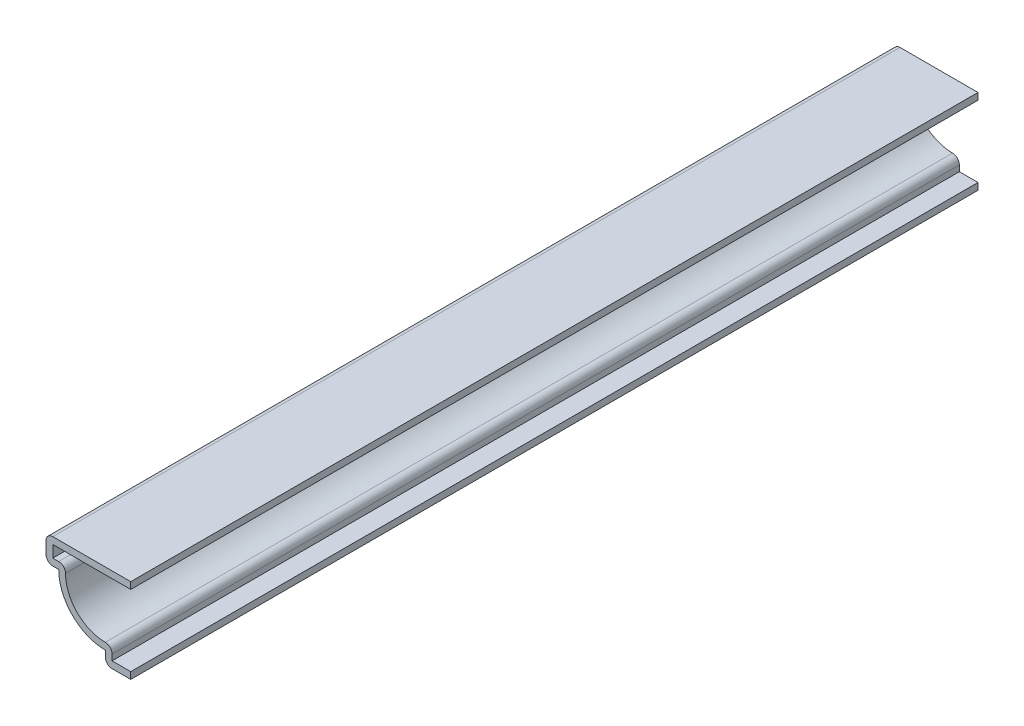
ISO-10303-21;
HEADER;
FILE_DESCRIPTION(('STEP AP214'),'2;1');
FILE_NAME('part.step','',(''),(''),'','','');
FILE_SCHEMA(('AUTOMOTIVE_DESIGN { 1 0 10303 214 1 1 1 1 }'));
ENDSEC;
DATA;
#1=APPLICATION_CONTEXT('core data for automotive mechanical design processes');
#2=APPLICATION_PROTOCOL_DEFINITION('international standard','automotive_design',2000,#1);
#3=PRODUCT_CONTEXT('',#1,'mechanical');
#4=PRODUCT('Part','Part','',(#3));
#5=PRODUCT_RELATED_PRODUCT_CATEGORY('part','',(#4));
#6=PRODUCT_DEFINITION_FORMATION('','',#4);
#7=PRODUCT_DEFINITION_CONTEXT('part definition',#1,'design');
#8=PRODUCT_DEFINITION('design','',#6,#7);
#9=PRODUCT_DEFINITION_SHAPE('','',#8);
#10=(LENGTH_UNIT() NAMED_UNIT(*) SI_UNIT(.MILLI.,.METRE.));
#11=(NAMED_UNIT(*) PLANE_ANGLE_UNIT() SI_UNIT($,.RADIAN.));
#12=(NAMED_UNIT(*) SI_UNIT($,.STERADIAN.) SOLID_ANGLE_UNIT());
#13=UNCERTAINTY_MEASURE_WITH_UNIT(LENGTH_MEASURE(1.E-05),#10,'distance_accuracy_value','');
#14=(GEOMETRIC_REPRESENTATION_CONTEXT(3) GLOBAL_UNCERTAINTY_ASSIGNED_CONTEXT((#13)) GLOBAL_UNIT_ASSIGNED_CONTEXT((#10,
#11,#12)) REPRESENTATION_CONTEXT('',''));
#15=CARTESIAN_POINT('',(0.,0.,0.));
#16=DIRECTION('',(0.,0.,1.));
#17=DIRECTION('',(1.,0.,0.));
#18=AXIS2_PLACEMENT_3D('',#15,#16,#17);
#19=CARTESIAN_POINT('',(-15.875,14.605,-158.75));
#20=DIRECTION('',(0.,-1.,0.));
#21=DIRECTION('',(0.,0.,-1.));
#22=AXIS2_PLACEMENT_3D('',#19,#20,#21);
#23=PLANE('',#22);
#24=DIRECTION('',(1.,0.,0.));
#25=VECTOR('',#24,1.);
#26=CARTESIAN_POINT('',(-15.875,14.605,0.));
#27=LINE('',#26,#25);
#28=CARTESIAN_POINT('',(-14.605,14.605,0.));
#29=VERTEX_POINT('',#28);
#30=CARTESIAN_POINT('',(0.,14.605,0.));
#31=VERTEX_POINT('',#30);
#32=EDGE_CURVE('E224',#29,#31,#27,.T.);
#33=ORIENTED_EDGE('',*,*,#32,.F.);
#34=DIRECTION('',(0.,0.,1.));
#35=VECTOR('',#34,1.);
#36=CARTESIAN_POINT('',(-14.605,14.605,-158.75));
#37=LINE('',#36,#35);
#38=CARTESIAN_POINT('',(-14.605,14.605,-158.75));
#39=VERTEX_POINT('',#38);
#40=EDGE_CURVE('E191',#39,#29,#37,.T.);
#41=ORIENTED_EDGE('',*,*,#40,.F.);
#42=DIRECTION('',(1.,0.,0.));
#43=VECTOR('',#42,1.);
#44=CARTESIAN_POINT('',(-15.875,14.605,-158.75));
#45=LINE('',#44,#43);
#46=CARTESIAN_POINT('',(0.,14.605,-158.75));
#47=VERTEX_POINT('',#46);
#48=EDGE_CURVE('E173',#39,#47,#45,.T.);
#49=ORIENTED_EDGE('',*,*,#48,.T.);
#50=DIRECTION('',(0.,0.,1.));
#51=VECTOR('',#50,1.);
#52=CARTESIAN_POINT('',(0.,14.605,-158.75));
#53=LINE('',#52,#51);
#54=EDGE_CURVE('E181',#47,#31,#53,.T.);
#55=ORIENTED_EDGE('',*,*,#54,.T.);
#56=EDGE_LOOP('',(#33,#41,#49,#55));
#57=FACE_BOUND('',#56,.T.);
#58=ADVANCED_FACE('F35',(#57),#23,.T.);
#59=CARTESIAN_POINT('',(-14.605,11.1125,-158.75));
#60=DIRECTION('',(1.,0.,0.));
#61=DIRECTION('',(0.,0.,-1.));
#62=AXIS2_PLACEMENT_3D('',#59,#60,#61);
#63=PLANE('',#62);
#64=DIRECTION('',(0.,1.,0.));
#65=VECTOR('',#64,1.);
#66=CARTESIAN_POINT('',(-14.605,11.1125,0.));
#67=LINE('',#66,#65);
#68=CARTESIAN_POINT('',(-14.605,12.3825,0.));
#69=VERTEX_POINT('',#68);
#70=EDGE_CURVE('E192',#69,#29,#67,.T.);
#71=ORIENTED_EDGE('',*,*,#70,.F.);
#72=DIRECTION('',(0.,0.,1.));
#73=VECTOR('',#72,1.);
#74=CARTESIAN_POINT('',(-14.605,12.3825,-158.75));
#75=LINE('',#74,#73);
#76=CARTESIAN_POINT('',(-14.605,12.3825,-158.75));
#77=VERTEX_POINT('',#76);
#78=EDGE_CURVE('E255',#77,#69,#75,.T.);
#79=ORIENTED_EDGE('',*,*,#78,.F.);
#80=DIRECTION('',(0.,1.,0.));
#81=VECTOR('',#80,1.);
#82=CARTESIAN_POINT('',(-14.605,11.1125,-158.75));
#83=LINE('',#82,#81);
#84=EDGE_CURVE('E189',#77,#39,#83,.T.);
#85=ORIENTED_EDGE('',*,*,#84,.T.);
#86=ORIENTED_EDGE('',*,*,#40,.T.);
#87=EDGE_LOOP('',(#71,#79,#85,#86));
#88=FACE_BOUND('',#87,.T.);
#89=ADVANCED_FACE('F333',(#88),#63,.T.);
#90=CARTESIAN_POINT('',(-13.49375,12.3825,-158.75));
#91=DIRECTION('',(0.,1.,0.));
#92=DIRECTION('',(0.,0.,1.));
#93=AXIS2_PLACEMENT_3D('',#90,#91,#92);
#94=PLANE('',#93);
#95=DIRECTION('',(1.,0.,0.));
#96=VECTOR('',#95,1.);
#97=CARTESIAN_POINT('',(-13.49375,12.3825,0.));
#98=LINE('',#97,#96);
#99=CARTESIAN_POINT('',(-13.49375,12.3825,0.));
#100=VERTEX_POINT('',#99);
#101=EDGE_CURVE('E195',#100,#69,#98,.F.);
#102=ORIENTED_EDGE('',*,*,#101,.F.);
#103=DIRECTION('',(0.,0.,1.));
#104=VECTOR('',#103,1.);
#105=CARTESIAN_POINT('',(-13.49375,12.3825,-158.75));
#106=LINE('',#105,#104);
#107=CARTESIAN_POINT('',(-13.49375,12.3825,-158.75));
#108=VERTEX_POINT('',#107);
#109=EDGE_CURVE('E303',#100,#108,#106,.F.);
#110=ORIENTED_EDGE('',*,*,#109,.T.);
#111=DIRECTION('',(1.,0.,0.));
#112=VECTOR('',#111,1.);
#113=CARTESIAN_POINT('',(-13.49375,12.3825,-158.75));
#114=LINE('',#113,#112);
#115=EDGE_CURVE('E221',#108,#77,#114,.F.);
#116=ORIENTED_EDGE('',*,*,#115,.T.);
#117=ORIENTED_EDGE('',*,*,#78,.T.);
#118=EDGE_LOOP('',(#102,#110,#116,#117));
#119=FACE_BOUND('',#118,.T.);
#120=ADVANCED_FACE('F392',(#119),#94,.T.);
#121=CARTESIAN_POINT('',(-4.7625,11.1125,-158.75));
#122=DIRECTION('',(0.,0.,1.));
#123=DIRECTION('',(1.,0.,0.));
#124=AXIS2_PLACEMENT_3D('',#121,#122,#123);
#125=CYLINDRICAL_SURFACE('',#124,7.46125);
#126=CARTESIAN_POINT('',(-4.7625,11.1125,0.));
#127=DIRECTION('',(0.,0.,1.));
#128=DIRECTION('',(1.,0.,0.));
#129=AXIS2_PLACEMENT_3D('',#126,#127,#128);
#130=CIRCLE('',#129,7.46125);
#131=CARTESIAN_POINT('',(-4.7625,3.65125,0.));
#132=VERTEX_POINT('',#131);
#133=CARTESIAN_POINT('',(-12.22375,11.1125,0.));
#134=VERTEX_POINT('',#133);
#135=EDGE_CURVE('E249',#132,#134,#130,.F.);
#136=ORIENTED_EDGE('',*,*,#135,.F.);
#137=DIRECTION('',(0.,0.,1.));
#138=VECTOR('',#137,1.);
#139=CARTESIAN_POINT('',(-4.7625,3.65125,-158.75));
#140=LINE('',#139,#138);
#141=CARTESIAN_POINT('',(-4.7625,3.65125,-158.75));
#142=VERTEX_POINT('',#141);
#143=EDGE_CURVE('E301',#132,#142,#140,.F.);
#144=ORIENTED_EDGE('',*,*,#143,.T.);
#145=CARTESIAN_POINT('',(-4.7625,11.1125,-158.75));
#146=DIRECTION('',(0.,0.,1.));
#147=DIRECTION('',(1.,0.,0.));
#148=AXIS2_PLACEMENT_3D('',#145,#146,#147);
#149=CIRCLE('',#148,7.46125);
#150=CARTESIAN_POINT('',(-12.22375,11.1125,-158.75));
#151=VERTEX_POINT('',#150);
#152=EDGE_CURVE('E218',#142,#151,#149,.F.);
#153=ORIENTED_EDGE('',*,*,#152,.T.);
#154=DIRECTION('',(0.,0.,1.));
#155=VECTOR('',#154,1.);
#156=CARTESIAN_POINT('',(-12.22375,11.1125,-158.75));
#157=LINE('',#156,#155);
#158=EDGE_CURVE('E298',#151,#134,#157,.T.);
#159=ORIENTED_EDGE('',*,*,#158,.T.);
#160=EDGE_LOOP('',(#136,#144,#153,#159));
#161=FACE_BOUND('',#160,.T.);
#162=ADVANCED_FACE('F344',(#161),#125,.F.);
#163=CARTESIAN_POINT('',(-3.4925,0.,-158.75));
#164=DIRECTION('',(1.,0.,0.));
#165=DIRECTION('',(0.,0.,-1.));
#166=AXIS2_PLACEMENT_3D('',#163,#164,#165);
#167=PLANE('',#166);
#168=DIRECTION('',(0.,1.,0.));
#169=VECTOR('',#168,1.);
#170=CARTESIAN_POINT('',(-3.4925,0.,-158.75));
#171=LINE('',#170,#169);
#172=CARTESIAN_POINT('',(-3.4925,1.27,-158.75));
#173=VERTEX_POINT('',#172);
#174=CARTESIAN_POINT('',(-3.4925,2.38125,-158.75));
#175=VERTEX_POINT('',#174);
#176=EDGE_CURVE('E215',#173,#175,#171,.T.);
#177=ORIENTED_EDGE('',*,*,#176,.T.);
#178=DIRECTION('',(0.,0.,1.));
#179=VECTOR('',#178,1.);
#180=CARTESIAN_POINT('',(-3.4925,2.38125,-158.75));
#181=LINE('',#180,#179);
#182=CARTESIAN_POINT('',(-3.4925,2.38125,0.));
#183=VERTEX_POINT('',#182);
#184=EDGE_CURVE('E295',#175,#183,#181,.T.);
#185=ORIENTED_EDGE('',*,*,#184,.T.);
#186=DIRECTION('',(0.,1.,0.));
#187=VECTOR('',#186,1.);
#188=CARTESIAN_POINT('',(-3.4925,0.,0.));
#189=LINE('',#188,#187);
#190=CARTESIAN_POINT('',(-3.4925,1.27,0.));
#191=VERTEX_POINT('',#190);
#192=EDGE_CURVE('E246',#191,#183,#189,.T.);
#193=ORIENTED_EDGE('',*,*,#192,.F.);
#194=DIRECTION('',(0.,0.,1.));
#195=VECTOR('',#194,1.);
#196=CARTESIAN_POINT('',(-3.4925,1.27,-158.75));
#197=LINE('',#196,#195);
#198=EDGE_CURVE('E258',#173,#191,#197,.T.);
#199=ORIENTED_EDGE('',*,*,#198,.F.);
#200=EDGE_LOOP('',(#177,#185,#193,#199));
#201=FACE_BOUND('',#200,.T.);
#202=ADVANCED_FACE('F352',(#201),#167,.T.);
#203=CARTESIAN_POINT('',(0.,1.27,-158.75));
#204=DIRECTION('',(0.,1.,0.));
#205=DIRECTION('',(-1.,0.,0.));
#206=AXIS2_PLACEMENT_3D('',#203,#204,#205);
#207=PLANE('',#206);
#208=DIRECTION('',(-1.,0.,0.));
#209=VECTOR('',#208,1.);
#210=CARTESIAN_POINT('',(0.,1.27,0.));
#211=LINE('',#210,#209);
#212=CARTESIAN_POINT('',(0.,1.27,0.));
#213=VERTEX_POINT('',#212);
#214=EDGE_CURVE('E243',#213,#191,#211,.T.);
#215=ORIENTED_EDGE('',*,*,#214,.F.);
#216=DIRECTION('',(0.,0.,1.));
#217=VECTOR('',#216,1.);
#218=CARTESIAN_POINT('',(0.,1.27,-158.75));
#219=LINE('',#218,#217);
#220=CARTESIAN_POINT('',(0.,1.27,-158.75));
#221=VERTEX_POINT('',#220);
#222=EDGE_CURVE('E260',#221,#213,#219,.T.);
#223=ORIENTED_EDGE('',*,*,#222,.F.);
#224=DIRECTION('',(-1.,0.,0.));
#225=VECTOR('',#224,1.);
#226=CARTESIAN_POINT('',(0.,1.27,-158.75));
#227=LINE('',#226,#225);
#228=EDGE_CURVE('E212',#221,#173,#227,.T.);
#229=ORIENTED_EDGE('',*,*,#228,.T.);
#230=ORIENTED_EDGE('',*,*,#198,.T.);
#231=EDGE_LOOP('',(#215,#223,#229,#230));
#232=FACE_BOUND('',#231,.T.);
#233=ADVANCED_FACE('F357',(#232),#207,.T.);
#234=CARTESIAN_POINT('',(0.,1.27,-158.75));
#235=DIRECTION('',(-1.,0.,0.));
#236=DIRECTION('',(0.,-1.,0.));
#237=AXIS2_PLACEMENT_3D('',#234,#235,#236);
#238=PLANE('',#237);
#239=DIRECTION('',(0.,-1.,0.));
#240=VECTOR('',#239,1.);
#241=CARTESIAN_POINT('',(0.,1.27,0.));
#242=LINE('',#241,#240);
#243=CARTESIAN_POINT('',(0.,0.,0.));
#244=VERTEX_POINT('',#243);
#245=EDGE_CURVE('E241',#213,#244,#242,.T.);
#246=ORIENTED_EDGE('',*,*,#245,.T.);
#247=DIRECTION('',(0.,0.,1.));
#248=VECTOR('',#247,1.);
#249=CARTESIAN_POINT('',(0.,0.,-158.75));
#250=LINE('',#249,#248);
#251=CARTESIAN_POINT('',(0.,0.,-158.75));
#252=VERTEX_POINT('',#251);
#253=EDGE_CURVE('E262',#252,#244,#250,.T.);
#254=ORIENTED_EDGE('',*,*,#253,.F.);
#255=DIRECTION('',(0.,-1.,0.));
#256=VECTOR('',#255,1.);
#257=CARTESIAN_POINT('',(0.,1.27,-158.75));
#258=LINE('',#257,#256);
#259=EDGE_CURVE('E210',#221,#252,#258,.T.);
#260=ORIENTED_EDGE('',*,*,#259,.F.);
#261=ORIENTED_EDGE('',*,*,#222,.T.);
#262=EDGE_LOOP('',(#246,#254,#260,#261));
#263=FACE_BOUND('',#262,.T.);
#264=ADVANCED_FACE('F362',(#263),#238,.F.);
#265=CARTESIAN_POINT('',(0.,0.,-158.75));
#266=DIRECTION('',(0.,1.,0.));
#267=DIRECTION('',(-1.,0.,0.));
#268=AXIS2_PLACEMENT_3D('',#265,#266,#267);
#269=PLANE('',#268);
#270=DIRECTION('',(-1.,0.,0.));
#271=VECTOR('',#270,1.);
#272=CARTESIAN_POINT('',(0.,0.,0.));
#273=LINE('',#272,#271);
#274=CARTESIAN_POINT('',(-3.4925,0.,0.));
#275=VERTEX_POINT('',#274);
#276=EDGE_CURVE('E238',#244,#275,#273,.T.);
#277=ORIENTED_EDGE('',*,*,#276,.T.);
#278=DIRECTION('',(0.,0.,1.));
#279=VECTOR('',#278,1.);
#280=CARTESIAN_POINT('',(-3.4925,0.,-158.75));
#281=LINE('',#280,#279);
#282=CARTESIAN_POINT('',(-3.4925,0.,-158.75));
#283=VERTEX_POINT('',#282);
#284=EDGE_CURVE('E284',#275,#283,#281,.F.);
#285=ORIENTED_EDGE('',*,*,#284,.T.);
#286=DIRECTION('',(-1.,0.,0.));
#287=VECTOR('',#286,1.);
#288=CARTESIAN_POINT('',(0.,0.,-158.75));
#289=LINE('',#288,#287);
#290=EDGE_CURVE('E208',#252,#283,#289,.T.);
#291=ORIENTED_EDGE('',*,*,#290,.F.);
#292=ORIENTED_EDGE('',*,*,#253,.T.);
#293=EDGE_LOOP('',(#277,#285,#291,#292));
#294=FACE_BOUND('',#293,.T.);
#295=ADVANCED_FACE('F385',(#294),#269,.F.);
#296=CARTESIAN_POINT('',(-4.7625,0.,-158.75));
#297=DIRECTION('',(1.,0.,0.));
#298=DIRECTION('',(0.,0.,-1.));
#299=AXIS2_PLACEMENT_3D('',#296,#297,#298);
#300=PLANE('',#299);
#301=DIRECTION('',(0.,1.,0.));
#302=VECTOR('',#301,1.);
#303=CARTESIAN_POINT('',(-4.7625,0.,-158.75));
#304=LINE('',#303,#302);
#305=CARTESIAN_POINT('',(-4.7625,1.27,-158.75));
#306=VERTEX_POINT('',#305);
#307=CARTESIAN_POINT('',(-4.7625,2.38125,-158.75));
#308=VERTEX_POINT('',#307);
#309=EDGE_CURVE('E206',#306,#308,#304,.T.);
#310=ORIENTED_EDGE('',*,*,#309,.F.);
#311=DIRECTION('',(0.,0.,1.));
#312=VECTOR('',#311,1.);
#313=CARTESIAN_POINT('',(-4.7625,1.27,-158.75));
#314=LINE('',#313,#312);
#315=CARTESIAN_POINT('',(-4.7625,1.27,0.));
#316=VERTEX_POINT('',#315);
#317=EDGE_CURVE('E254',#306,#316,#314,.T.);
#318=ORIENTED_EDGE('',*,*,#317,.T.);
#319=DIRECTION('',(0.,1.,0.));
#320=VECTOR('',#319,1.);
#321=CARTESIAN_POINT('',(-4.7625,0.,0.));
#322=LINE('',#321,#320);
#323=CARTESIAN_POINT('',(-4.7625,2.38125,0.));
#324=VERTEX_POINT('',#323);
#325=EDGE_CURVE('E236',#316,#324,#322,.T.);
#326=ORIENTED_EDGE('',*,*,#325,.T.);
#327=DIRECTION('',(0.,0.,1.));
#328=VECTOR('',#327,1.);
#329=CARTESIAN_POINT('',(-4.7625,2.38125,-158.75));
#330=LINE('',#329,#328);
#331=EDGE_CURVE('E265',#308,#324,#330,.T.);
#332=ORIENTED_EDGE('',*,*,#331,.F.);
#333=EDGE_LOOP('',(#310,#318,#326,#332));
#334=FACE_BOUND('',#333,.T.);
#335=ADVANCED_FACE('F372',(#334),#300,.F.);
#336=CARTESIAN_POINT('',(-4.7625,11.1125,-158.75));
#337=DIRECTION('',(0.,0.,1.));
#338=DIRECTION('',(1.,0.,0.));
#339=AXIS2_PLACEMENT_3D('',#336,#337,#338);
#340=CYLINDRICAL_SURFACE('',#339,8.73125);
#341=CARTESIAN_POINT('',(-4.7625,11.1125,0.));
#342=DIRECTION('',(0.,0.,-1.));
#343=DIRECTION('',(-1.,0.,0.));
#344=AXIS2_PLACEMENT_3D('',#341,#342,#343);
#345=CIRCLE('',#344,8.73125);
#346=CARTESIAN_POINT('',(-13.49375,11.1125,0.));
#347=VERTEX_POINT('',#346);
#348=EDGE_CURVE('E234',#324,#347,#345,.T.);
#349=ORIENTED_EDGE('',*,*,#348,.T.);
#350=DIRECTION('',(0.,0.,1.));
#351=VECTOR('',#350,1.);
#352=CARTESIAN_POINT('',(-13.49375,11.1125,-158.75));
#353=LINE('',#352,#351);
#354=CARTESIAN_POINT('',(-13.49375,11.1125,-158.75));
#355=VERTEX_POINT('',#354);
#356=EDGE_CURVE('E268',#355,#347,#353,.T.);
#357=ORIENTED_EDGE('',*,*,#356,.F.);
#358=CARTESIAN_POINT('',(-4.7625,11.1125,-158.75));
#359=DIRECTION('',(0.,0.,-1.));
#360=DIRECTION('',(-1.,0.,0.));
#361=AXIS2_PLACEMENT_3D('',#358,#359,#360);
#362=CIRCLE('',#361,8.73125);
#363=EDGE_CURVE('E204',#308,#355,#362,.T.);
#364=ORIENTED_EDGE('',*,*,#363,.F.);
#365=ORIENTED_EDGE('',*,*,#331,.T.);
#366=EDGE_LOOP('',(#349,#357,#364,#365));
#367=FACE_BOUND('',#366,.T.);
#368=ADVANCED_FACE('F377',(#367),#340,.T.);
#369=CARTESIAN_POINT('',(-13.49375,11.1125,-158.75));
#370=DIRECTION('',(0.,1.,0.));
#371=DIRECTION('',(0.,0.,1.));
#372=AXIS2_PLACEMENT_3D('',#369,#370,#371);
#373=PLANE('',#372);
#374=DIRECTION('',(-1.,0.,0.));
#375=VECTOR('',#374,1.);
#376=CARTESIAN_POINT('',(-13.49375,11.1125,0.));
#377=LINE('',#376,#375);
#378=CARTESIAN_POINT('',(-14.605,11.1125,0.));
#379=VERTEX_POINT('',#378);
#380=EDGE_CURVE('E231',#347,#379,#377,.T.);
#381=ORIENTED_EDGE('',*,*,#380,.T.);
#382=DIRECTION('',(0.,0.,1.));
#383=VECTOR('',#382,1.);
#384=CARTESIAN_POINT('',(-14.605,11.1125,-158.75));
#385=LINE('',#384,#383);
#386=CARTESIAN_POINT('',(-14.605,11.1125,-158.75));
#387=VERTEX_POINT('',#386);
#388=EDGE_CURVE('E43',#379,#387,#385,.F.);
#389=ORIENTED_EDGE('',*,*,#388,.T.);
#390=DIRECTION('',(-1.,0.,0.));
#391=VECTOR('',#390,1.);
#392=CARTESIAN_POINT('',(-13.49375,11.1125,-158.75));
#393=LINE('',#392,#391);
#394=EDGE_CURVE('E201',#355,#387,#393,.T.);
#395=ORIENTED_EDGE('',*,*,#394,.F.);
#396=ORIENTED_EDGE('',*,*,#356,.T.);
#397=EDGE_LOOP('',(#381,#389,#395,#396));
#398=FACE_BOUND('',#397,.T.);
#399=ADVANCED_FACE('F311',(#398),#373,.F.);
#400=CARTESIAN_POINT('',(-15.875,11.1125,-158.75));
#401=DIRECTION('',(1.,0.,0.));
#402=DIRECTION('',(0.,0.,-1.));
#403=AXIS2_PLACEMENT_3D('',#400,#401,#402);
#404=PLANE('',#403);
#405=DIRECTION('',(0.,1.,0.));
#406=VECTOR('',#405,1.);
#407=CARTESIAN_POINT('',(-15.875,11.1125,-158.75));
#408=LINE('',#407,#406);
#409=CARTESIAN_POINT('',(-15.875,12.3825,-158.75));
#410=VERTEX_POINT('',#409);
#411=CARTESIAN_POINT('',(-15.875,14.605,-158.75));
#412=VERTEX_POINT('',#411);
#413=EDGE_CURVE('E199',#410,#412,#408,.T.);
#414=ORIENTED_EDGE('',*,*,#413,.F.);
#415=DIRECTION('',(0.,0.,1.));
#416=VECTOR('',#415,1.);
#417=CARTESIAN_POINT('',(-15.875,12.3825,-158.75));
#418=LINE('',#417,#416);
#419=CARTESIAN_POINT('',(-15.875,12.3825,0.));
#420=VERTEX_POINT('',#419);
#421=EDGE_CURVE('E306',#410,#420,#418,.T.);
#422=ORIENTED_EDGE('',*,*,#421,.T.);
#423=DIRECTION('',(0.,1.,0.));
#424=VECTOR('',#423,1.);
#425=CARTESIAN_POINT('',(-15.875,11.1125,0.));
#426=LINE('',#425,#424);
#427=CARTESIAN_POINT('',(-15.875,14.605,0.));
#428=VERTEX_POINT('',#427);
#429=EDGE_CURVE('E229',#420,#428,#426,.T.);
#430=ORIENTED_EDGE('',*,*,#429,.T.);
#431=DIRECTION('',(0.,0.,1.));
#432=VECTOR('',#431,1.);
#433=CARTESIAN_POINT('',(-15.875,14.605,-158.75));
#434=LINE('',#433,#432);
#435=EDGE_CURVE('E58',#428,#412,#434,.F.);
#436=ORIENTED_EDGE('',*,*,#435,.T.);
#437=EDGE_LOOP('',(#414,#422,#430,#436));
#438=FACE_BOUND('',#437,.T.);
#439=ADVANCED_FACE('F320',(#438),#404,.F.);
#440=CARTESIAN_POINT('',(-15.875,15.875,-158.75));
#441=DIRECTION('',(0.,-1.,0.));
#442=DIRECTION('',(0.,0.,-1.));
#443=AXIS2_PLACEMENT_3D('',#440,#441,#442);
#444=PLANE('',#443);
#445=DIRECTION('',(1.,0.,0.));
#446=VECTOR('',#445,1.);
#447=CARTESIAN_POINT('',(-15.875,15.875,-158.75));
#448=LINE('',#447,#446);
#449=CARTESIAN_POINT('',(-14.605,15.875,-158.75));
#450=VERTEX_POINT('',#449);
#451=CARTESIAN_POINT('',(0.,15.875,-158.75));
#452=VERTEX_POINT('',#451);
#453=EDGE_CURVE('E175',#450,#452,#448,.T.);
#454=ORIENTED_EDGE('',*,*,#453,.F.);
#455=DIRECTION('',(0.,0.,1.));
#456=VECTOR('',#455,1.);
#457=CARTESIAN_POINT('',(-14.605,15.875,-158.75));
#458=LINE('',#457,#456);
#459=CARTESIAN_POINT('',(-14.605,15.875,0.));
#460=VERTEX_POINT('',#459);
#461=EDGE_CURVE('E11',#450,#460,#458,.T.);
#462=ORIENTED_EDGE('',*,*,#461,.T.);
#463=DIRECTION('',(1.,0.,0.));
#464=VECTOR('',#463,1.);
#465=CARTESIAN_POINT('',(-15.875,15.875,0.));
#466=LINE('',#465,#464);
#467=CARTESIAN_POINT('',(0.,15.875,0.));
#468=VERTEX_POINT('',#467);
#469=EDGE_CURVE('E227',#460,#468,#466,.T.);
#470=ORIENTED_EDGE('',*,*,#469,.T.);
#471=DIRECTION('',(0.,0.,1.));
#472=VECTOR('',#471,1.);
#473=CARTESIAN_POINT('',(0.,15.875,-158.75));
#474=LINE('',#473,#472);
#475=EDGE_CURVE('E188',#452,#468,#474,.T.);
#476=ORIENTED_EDGE('',*,*,#475,.F.);
#477=EDGE_LOOP('',(#454,#462,#470,#476));
#478=FACE_BOUND('',#477,.T.);
#479=ADVANCED_FACE('F328',(#478),#444,.F.);
#480=CARTESIAN_POINT('',(0.,15.875,-158.75));
#481=DIRECTION('',(-1.,0.,0.));
#482=DIRECTION('',(0.,0.,1.));
#483=AXIS2_PLACEMENT_3D('',#480,#481,#482);
#484=PLANE('',#483);
#485=DIRECTION('',(0.,-1.,0.));
#486=VECTOR('',#485,1.);
#487=CARTESIAN_POINT('',(0.,15.875,0.));
#488=LINE('',#487,#486);
#489=EDGE_CURVE('E184',#468,#31,#488,.T.);
#490=ORIENTED_EDGE('',*,*,#489,.T.);
#491=ORIENTED_EDGE('',*,*,#54,.F.);
#492=DIRECTION('',(0.,-1.,0.));
#493=VECTOR('',#492,1.);
#494=CARTESIAN_POINT('',(0.,15.875,-158.75));
#495=LINE('',#494,#493);
#496=EDGE_CURVE('E167',#452,#47,#495,.T.);
#497=ORIENTED_EDGE('',*,*,#496,.F.);
#498=ORIENTED_EDGE('',*,*,#475,.T.);
#499=EDGE_LOOP('',(#490,#491,#497,#498));
#500=FACE_BOUND('',#499,.T.);
#501=ADVANCED_FACE('F182',(#500),#484,.F.);
#502=CARTESIAN_POINT('',(-4.7625,11.1125,-158.75));
#503=DIRECTION('',(0.,0.,-1.));
#504=DIRECTION('',(-1.,0.,0.));
#505=AXIS2_PLACEMENT_3D('',#502,#503,#504);
#506=PLANE('',#505);
#507=ORIENTED_EDGE('',*,*,#290,.T.);
#508=CARTESIAN_POINT('',(-3.4925,1.27,-158.75));
#509=DIRECTION('',(0.,0.,-1.));
#510=DIRECTION('',(-1.,0.,0.));
#511=AXIS2_PLACEMENT_3D('',#508,#509,#510);
#512=CIRCLE('',#511,1.27);
#513=EDGE_CURVE('E293',#283,#306,#512,.T.);
#514=ORIENTED_EDGE('',*,*,#513,.T.);
#515=ORIENTED_EDGE('',*,*,#309,.T.);
#516=ORIENTED_EDGE('',*,*,#363,.T.);
#517=ORIENTED_EDGE('',*,*,#394,.T.);
#518=CARTESIAN_POINT('',(-14.605,12.3825,-158.75));
#519=DIRECTION('',(0.,0.,-1.));
#520=DIRECTION('',(-1.,0.,0.));
#521=AXIS2_PLACEMENT_3D('',#518,#519,#520);
#522=CIRCLE('',#521,1.27);
#523=EDGE_CURVE('E287',#387,#410,#522,.T.);
#524=ORIENTED_EDGE('',*,*,#523,.T.);
#525=ORIENTED_EDGE('',*,*,#413,.T.);
#526=CARTESIAN_POINT('',(-14.605,14.605,-158.75));
#527=DIRECTION('',(0.,0.,-1.));
#528=DIRECTION('',(-1.,0.,0.));
#529=AXIS2_PLACEMENT_3D('',#526,#527,#528);
#530=CIRCLE('',#529,1.27);
#531=EDGE_CURVE('E50',#412,#450,#530,.T.);
#532=ORIENTED_EDGE('',*,*,#531,.T.);
#533=ORIENTED_EDGE('',*,*,#453,.T.);
#534=ORIENTED_EDGE('',*,*,#496,.T.);
#535=ORIENTED_EDGE('',*,*,#48,.F.);
#536=ORIENTED_EDGE('',*,*,#84,.F.);
#537=ORIENTED_EDGE('',*,*,#115,.F.);
#538=CARTESIAN_POINT('',(-13.49375,11.1125,-158.75));
#539=DIRECTION('',(0.,0.,-1.));
#540=DIRECTION('',(-1.,0.,0.));
#541=AXIS2_PLACEMENT_3D('',#538,#539,#540);
#542=CIRCLE('',#541,1.27);
#543=EDGE_CURVE('E289',#108,#151,#542,.T.);
#544=ORIENTED_EDGE('',*,*,#543,.T.);
#545=ORIENTED_EDGE('',*,*,#152,.F.);
#546=CARTESIAN_POINT('',(-4.7625,2.38125,-158.75));
#547=DIRECTION('',(0.,0.,-1.));
#548=DIRECTION('',(-1.,0.,0.));
#549=AXIS2_PLACEMENT_3D('',#546,#547,#548);
#550=CIRCLE('',#549,1.27);
#551=EDGE_CURVE('E291',#142,#175,#550,.T.);
#552=ORIENTED_EDGE('',*,*,#551,.T.);
#553=ORIENTED_EDGE('',*,*,#176,.F.);
#554=ORIENTED_EDGE('',*,*,#228,.F.);
#555=ORIENTED_EDGE('',*,*,#259,.T.);
#556=EDGE_LOOP('',(#507,#514,#515,#516,#517,#524,#525,#532,#533,#534,#535,#536,#537,#544,#545,
#552,#553,#554,#555));
#557=FACE_BOUND('',#556,.T.);
#558=ADVANCED_FACE('F170',(#557),#506,.T.);
#559=CARTESIAN_POINT('',(-4.7625,11.1125,0.));
#560=DIRECTION('',(0.,0.,-1.));
#561=DIRECTION('',(-1.,0.,0.));
#562=AXIS2_PLACEMENT_3D('',#559,#560,#561);
#563=PLANE('',#562);
#564=ORIENTED_EDGE('',*,*,#325,.F.);
#565=CARTESIAN_POINT('',(-3.4925,1.27,0.));
#566=DIRECTION('',(0.,0.,-1.));
#567=DIRECTION('',(-1.,0.,0.));
#568=AXIS2_PLACEMENT_3D('',#565,#566,#567);
#569=CIRCLE('',#568,1.27);
#570=EDGE_CURVE('E282',#316,#275,#569,.F.);
#571=ORIENTED_EDGE('',*,*,#570,.T.);
#572=ORIENTED_EDGE('',*,*,#276,.F.);
#573=ORIENTED_EDGE('',*,*,#245,.F.);
#574=ORIENTED_EDGE('',*,*,#214,.T.);
#575=ORIENTED_EDGE('',*,*,#192,.T.);
#576=CARTESIAN_POINT('',(-4.7625,2.38125,0.));
#577=DIRECTION('',(0.,0.,-1.));
#578=DIRECTION('',(-1.,0.,0.));
#579=AXIS2_PLACEMENT_3D('',#576,#577,#578);
#580=CIRCLE('',#579,1.27);
#581=EDGE_CURVE('E280',#183,#132,#580,.F.);
#582=ORIENTED_EDGE('',*,*,#581,.T.);
#583=ORIENTED_EDGE('',*,*,#135,.T.);
#584=CARTESIAN_POINT('',(-13.49375,11.1125,0.));
#585=DIRECTION('',(0.,0.,-1.));
#586=DIRECTION('',(-1.,0.,0.));
#587=AXIS2_PLACEMENT_3D('',#584,#585,#586);
#588=CIRCLE('',#587,1.27);
#589=EDGE_CURVE('E278',#134,#100,#588,.F.);
#590=ORIENTED_EDGE('',*,*,#589,.T.);
#591=ORIENTED_EDGE('',*,*,#101,.T.);
#592=ORIENTED_EDGE('',*,*,#70,.T.);
#593=ORIENTED_EDGE('',*,*,#32,.T.);
#594=ORIENTED_EDGE('',*,*,#489,.F.);
#595=ORIENTED_EDGE('',*,*,#469,.F.);
#596=CARTESIAN_POINT('',(-14.605,14.605,0.));
#597=DIRECTION('',(0.,0.,-1.));
#598=DIRECTION('',(-1.,0.,0.));
#599=AXIS2_PLACEMENT_3D('',#596,#597,#598);
#600=CIRCLE('',#599,1.27);
#601=EDGE_CURVE('E274',#460,#428,#600,.F.);
#602=ORIENTED_EDGE('',*,*,#601,.T.);
#603=ORIENTED_EDGE('',*,*,#429,.F.);
#604=CARTESIAN_POINT('',(-14.605,12.3825,0.));
#605=DIRECTION('',(0.,0.,-1.));
#606=DIRECTION('',(-1.,0.,0.));
#607=AXIS2_PLACEMENT_3D('',#604,#605,#606);
#608=CIRCLE('',#607,1.27);
#609=EDGE_CURVE('E276',#420,#379,#608,.F.);
#610=ORIENTED_EDGE('',*,*,#609,.T.);
#611=ORIENTED_EDGE('',*,*,#380,.F.);
#612=ORIENTED_EDGE('',*,*,#348,.F.);
#613=EDGE_LOOP('',(#564,#571,#572,#573,#574,#575,#582,#583,#590,#591,#592,#593,#594,#595,#602,
#603,#610,#611,#612));
#614=FACE_BOUND('',#613,.T.);
#615=ADVANCED_FACE('F323',(#614),#563,.F.);
#616=CARTESIAN_POINT('',(-3.4925,1.27,-158.75));
#617=DIRECTION('',(0.,0.,1.));
#618=DIRECTION('',(1.,0.,0.));
#619=AXIS2_PLACEMENT_3D('',#616,#617,#618);
#620=CYLINDRICAL_SURFACE('',#619,1.27);
#621=ORIENTED_EDGE('',*,*,#513,.F.);
#622=ORIENTED_EDGE('',*,*,#284,.F.);
#623=ORIENTED_EDGE('',*,*,#570,.F.);
#624=ORIENTED_EDGE('',*,*,#317,.F.);
#625=EDGE_LOOP('',(#621,#622,#623,#624));
#626=FACE_BOUND('',#625,.T.);
#627=ADVANCED_FACE('F370',(#626),#620,.T.);
#628=CARTESIAN_POINT('',(-4.7625,2.38125,-158.75));
#629=DIRECTION('',(0.,0.,1.));
#630=DIRECTION('',(1.,0.,0.));
#631=AXIS2_PLACEMENT_3D('',#628,#629,#630);
#632=CYLINDRICAL_SURFACE('',#631,1.27);
#633=ORIENTED_EDGE('',*,*,#551,.F.);
#634=ORIENTED_EDGE('',*,*,#143,.F.);
#635=ORIENTED_EDGE('',*,*,#581,.F.);
#636=ORIENTED_EDGE('',*,*,#184,.F.);
#637=EDGE_LOOP('',(#633,#634,#635,#636));
#638=FACE_BOUND('',#637,.T.);
#639=ADVANCED_FACE('F350',(#638),#632,.T.);
#640=CARTESIAN_POINT('',(-13.49375,11.1125,-158.75));
#641=DIRECTION('',(0.,0.,1.));
#642=DIRECTION('',(1.,0.,0.));
#643=AXIS2_PLACEMENT_3D('',#640,#641,#642);
#644=CYLINDRICAL_SURFACE('',#643,1.27);
#645=ORIENTED_EDGE('',*,*,#543,.F.);
#646=ORIENTED_EDGE('',*,*,#109,.F.);
#647=ORIENTED_EDGE('',*,*,#589,.F.);
#648=ORIENTED_EDGE('',*,*,#158,.F.);
#649=EDGE_LOOP('',(#645,#646,#647,#648));
#650=FACE_BOUND('',#649,.T.);
#651=ADVANCED_FACE('F341',(#650),#644,.T.);
#652=CARTESIAN_POINT('',(-14.605,12.3825,-158.75));
#653=DIRECTION('',(0.,0.,1.));
#654=DIRECTION('',(1.,0.,0.));
#655=AXIS2_PLACEMENT_3D('',#652,#653,#654);
#656=CYLINDRICAL_SURFACE('',#655,1.27);
#657=ORIENTED_EDGE('',*,*,#523,.F.);
#658=ORIENTED_EDGE('',*,*,#388,.F.);
#659=ORIENTED_EDGE('',*,*,#609,.F.);
#660=ORIENTED_EDGE('',*,*,#421,.F.);
#661=EDGE_LOOP('',(#657,#658,#659,#660));
#662=FACE_BOUND('',#661,.T.);
#663=ADVANCED_FACE('F318',(#662),#656,.T.);
#664=CARTESIAN_POINT('',(-14.605,14.605,-158.75));
#665=DIRECTION('',(0.,0.,1.));
#666=DIRECTION('',(1.,0.,0.));
#667=AXIS2_PLACEMENT_3D('',#664,#665,#666);
#668=CYLINDRICAL_SURFACE('',#667,1.27);
#669=ORIENTED_EDGE('',*,*,#531,.F.);
#670=ORIENTED_EDGE('',*,*,#435,.F.);
#671=ORIENTED_EDGE('',*,*,#601,.F.);
#672=ORIENTED_EDGE('',*,*,#461,.F.);
#673=EDGE_LOOP('',(#669,#670,#671,#672));
#674=FACE_BOUND('',#673,.T.);
#675=ADVANCED_FACE('F37',(#674),#668,.T.);
#676=CLOSED_SHELL('',(#58,#89,#120,#162,#202,#233,#264,#295,#335,#368,#399,#439,#479,#501,#558,
#615,#627,#639,#651,#663,#675));
#677=MANIFOLD_SOLID_BREP('B2',#676);
#678=ADVANCED_BREP_SHAPE_REPRESENTATION('',(#18,#677),#14);
#679=SHAPE_DEFINITION_REPRESENTATION(#9,#678);
ENDSEC;
END-ISO-10303-21;
